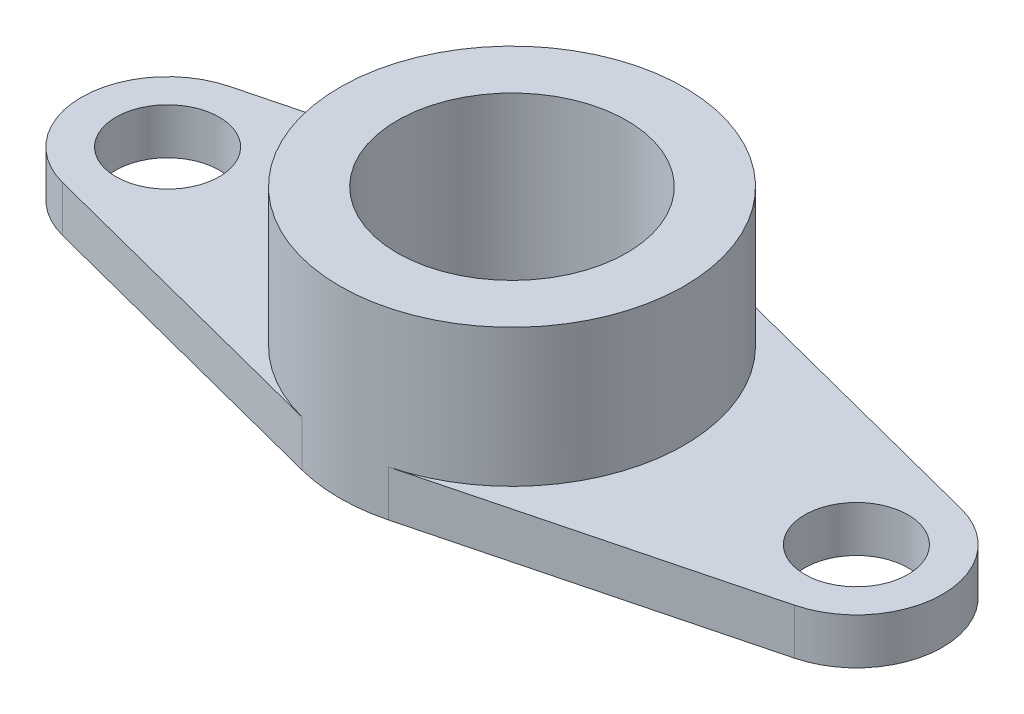
ISO-10303-21;
HEADER;
FILE_DESCRIPTION(('STEP AP214'),'2;1');
FILE_NAME('part.step','',(''),(''),'','','');
FILE_SCHEMA(('AUTOMOTIVE_DESIGN { 1 0 10303 214 1 1 1 1 }'));
ENDSEC;
DATA;
#1=APPLICATION_CONTEXT('core data for automotive mechanical design processes');
#2=APPLICATION_PROTOCOL_DEFINITION('international standard','automotive_design',2000,#1);
#3=PRODUCT_CONTEXT('',#1,'mechanical');
#4=PRODUCT('Part','Part','',(#3));
#5=PRODUCT_RELATED_PRODUCT_CATEGORY('part','',(#4));
#6=PRODUCT_DEFINITION_FORMATION('','',#4);
#7=PRODUCT_DEFINITION_CONTEXT('part definition',#1,'design');
#8=PRODUCT_DEFINITION('design','',#6,#7);
#9=PRODUCT_DEFINITION_SHAPE('','',#8);
#10=(LENGTH_UNIT() NAMED_UNIT(*) SI_UNIT(.MILLI.,.METRE.));
#11=(NAMED_UNIT(*) PLANE_ANGLE_UNIT() SI_UNIT($,.RADIAN.));
#12=(NAMED_UNIT(*) SI_UNIT($,.STERADIAN.) SOLID_ANGLE_UNIT());
#13=UNCERTAINTY_MEASURE_WITH_UNIT(LENGTH_MEASURE(1.E-05),#10,'distance_accuracy_value','');
#14=(GEOMETRIC_REPRESENTATION_CONTEXT(3) GLOBAL_UNCERTAINTY_ASSIGNED_CONTEXT((#13)) GLOBAL_UNIT_ASSIGNED_CONTEXT((#10,
#11,#12)) REPRESENTATION_CONTEXT('',''));
#15=CARTESIAN_POINT('',(0.,0.,0.));
#16=DIRECTION('',(0.,0.,1.));
#17=DIRECTION('',(1.,0.,0.));
#18=AXIS2_PLACEMENT_3D('',#15,#16,#17);
#19=CARTESIAN_POINT('',(0.,2.,0.));
#20=DIRECTION('',(0.,1.,0.));
#21=DIRECTION('',(0.,0.,1.));
#22=AXIS2_PLACEMENT_3D('',#19,#20,#21);
#23=PLANE('',#22);
#24=CARTESIAN_POINT('',(0.,2.,0.));
#25=DIRECTION('',(0.,1.,0.));
#26=DIRECTION('',(0.,0.,1.));
#27=AXIS2_PLACEMENT_3D('',#24,#25,#26);
#28=CIRCLE('',#27,7.5);
#29=CARTESIAN_POINT('',(1.875,2.,7.26184377413891));
#30=VERTEX_POINT('',#29);
#31=CARTESIAN_POINT('',(1.875,2.,-7.26184377413891));
#32=VERTEX_POINT('',#31);
#33=EDGE_CURVE('E46',#30,#32,#28,.T.);
#34=ORIENTED_EDGE('',*,*,#33,.F.);
#35=DIRECTION('',(-0.968245836551854,0.,0.25));
#36=VECTOR('',#35,1.);
#37=CARTESIAN_POINT('',(1.875,2.,7.26184377413891));
#38=LINE('',#37,#36);
#39=CARTESIAN_POINT('',(15.9375,2.,3.63092188706945));
#40=VERTEX_POINT('',#39);
#41=EDGE_CURVE('E115',#40,#30,#38,.T.);
#42=ORIENTED_EDGE('',*,*,#41,.F.);
#43=CARTESIAN_POINT('',(15.,2.,0.));
#44=DIRECTION('',(0.,1.,0.));
#45=DIRECTION('',(0.,0.,1.));
#46=AXIS2_PLACEMENT_3D('',#43,#44,#45);
#47=CIRCLE('',#46,3.75);
#48=CARTESIAN_POINT('',(15.9375,2.,-3.63092188706945));
#49=VERTEX_POINT('',#48);
#50=EDGE_CURVE('E108',#40,#49,#47,.T.);
#51=ORIENTED_EDGE('',*,*,#50,.T.);
#52=DIRECTION('',(-0.968245836551854,0.,-0.25));
#53=VECTOR('',#52,1.);
#54=CARTESIAN_POINT('',(1.875,2.,-7.26184377413891));
#55=LINE('',#54,#53);
#56=EDGE_CURVE('E113',#49,#32,#55,.T.);
#57=ORIENTED_EDGE('',*,*,#56,.T.);
#58=EDGE_LOOP('',(#34,#42,#51,#57));
#59=FACE_BOUND('',#58,.T.);
#60=CARTESIAN_POINT('',(15.,2.,0.));
#61=DIRECTION('',(0.,1.,0.));
#62=DIRECTION('',(0.,0.,1.));
#63=AXIS2_PLACEMENT_3D('',#60,#61,#62);
#64=CIRCLE('',#63,2.25);
#65=CARTESIAN_POINT('',(15.,2.,2.25));
#66=VERTEX_POINT('',#65);
#67=EDGE_CURVE('E130',#66,#66,#64,.T.);
#68=ORIENTED_EDGE('',*,*,#67,.F.);
#69=EDGE_LOOP('',(#68));
#70=FACE_BOUND('',#69,.T.);
#71=ADVANCED_FACE('F35',(#59,#70),#23,.T.);
#72=CARTESIAN_POINT('',(-1.875,2.,-7.26184377413891));
#73=DIRECTION('',(-0.25,0.,-0.968245836551854));
#74=DIRECTION('',(-0.968245836551854,0.,0.25));
#75=AXIS2_PLACEMENT_3D('',#72,#73,#74);
#76=PLANE('',#75);
#77=DIRECTION('',(0.968245836551854,0.,-0.25));
#78=VECTOR('',#77,1.);
#79=CARTESIAN_POINT('',(-1.875,0.,-7.26184377413891));
#80=LINE('',#79,#78);
#81=CARTESIAN_POINT('',(-15.9375,0.,-3.63092188706945));
#82=VERTEX_POINT('',#81);
#83=CARTESIAN_POINT('',(-1.875,0.,-7.26184377413891));
#84=VERTEX_POINT('',#83);
#85=EDGE_CURVE('E136',#82,#84,#80,.T.);
#86=ORIENTED_EDGE('',*,*,#85,.F.);
#87=DIRECTION('',(0.,-1.,0.));
#88=VECTOR('',#87,1.);
#89=CARTESIAN_POINT('',(-15.9375,2.,-3.63092188706945));
#90=LINE('',#89,#88);
#91=CARTESIAN_POINT('',(-15.9375,2.,-3.63092188706945));
#92=VERTEX_POINT('',#91);
#93=EDGE_CURVE('E39',#92,#82,#90,.T.);
#94=ORIENTED_EDGE('',*,*,#93,.F.);
#95=DIRECTION('',(0.968245836551854,0.,-0.25));
#96=VECTOR('',#95,1.);
#97=CARTESIAN_POINT('',(-1.875,2.,-7.26184377413891));
#98=LINE('',#97,#96);
#99=CARTESIAN_POINT('',(-1.875,2.,-7.26184377413891));
#100=VERTEX_POINT('',#99);
#101=EDGE_CURVE('E162',#92,#100,#98,.T.);
#102=ORIENTED_EDGE('',*,*,#101,.T.);
#103=DIRECTION('',(0.,-1.,0.));
#104=VECTOR('',#103,1.);
#105=CARTESIAN_POINT('',(-1.875,2.,-7.26184377413891));
#106=LINE('',#105,#104);
#107=EDGE_CURVE('E90',#100,#84,#106,.T.);
#108=ORIENTED_EDGE('',*,*,#107,.T.);
#109=EDGE_LOOP('',(#86,#94,#102,#108));
#110=FACE_BOUND('',#109,.T.);
#111=ADVANCED_FACE('F37',(#110),#76,.T.);
#112=CARTESIAN_POINT('',(-15.,2.,0.));
#113=DIRECTION('',(0.,-1.,0.));
#114=DIRECTION('',(0.,0.,-1.));
#115=AXIS2_PLACEMENT_3D('',#112,#113,#114);
#116=CYLINDRICAL_SURFACE('',#115,3.75);
#117=CARTESIAN_POINT('',(-15.,0.,0.));
#118=DIRECTION('',(0.,1.,0.));
#119=DIRECTION('',(0.,0.,1.));
#120=AXIS2_PLACEMENT_3D('',#117,#118,#119);
#121=CIRCLE('',#120,3.75);
#122=CARTESIAN_POINT('',(-15.9375,0.,3.63092188706945));
#123=VERTEX_POINT('',#122);
#124=EDGE_CURVE('E139',#82,#123,#121,.T.);
#125=ORIENTED_EDGE('',*,*,#124,.T.);
#126=DIRECTION('',(0.,-1.,0.));
#127=VECTOR('',#126,1.);
#128=CARTESIAN_POINT('',(-15.9375,2.,3.63092188706945));
#129=LINE('',#128,#127);
#130=CARTESIAN_POINT('',(-15.9375,2.,3.63092188706945));
#131=VERTEX_POINT('',#130);
#132=EDGE_CURVE('E170',#131,#123,#129,.T.);
#133=ORIENTED_EDGE('',*,*,#132,.F.);
#134=CARTESIAN_POINT('',(-15.,2.,0.));
#135=DIRECTION('',(0.,1.,0.));
#136=DIRECTION('',(0.,0.,1.));
#137=AXIS2_PLACEMENT_3D('',#134,#135,#136);
#138=CIRCLE('',#137,3.75);
#139=EDGE_CURVE('E179',#92,#131,#138,.T.);
#140=ORIENTED_EDGE('',*,*,#139,.F.);
#141=ORIENTED_EDGE('',*,*,#93,.T.);
#142=EDGE_LOOP('',(#125,#133,#140,#141));
#143=FACE_BOUND('',#142,.T.);
#144=ADVANCED_FACE('F178',(#143),#116,.T.);
#145=CARTESIAN_POINT('',(-1.875,2.,7.26184377413891));
#146=DIRECTION('',(0.25,0.,-0.968245836551854));
#147=DIRECTION('',(-0.968245836551854,0.,-0.25));
#148=AXIS2_PLACEMENT_3D('',#145,#146,#147);
#149=PLANE('',#148);
#150=DIRECTION('',(0.968245836551854,0.,0.25));
#151=VECTOR('',#150,1.);
#152=CARTESIAN_POINT('',(-1.875,0.,7.26184377413891));
#153=LINE('',#152,#151);
#154=CARTESIAN_POINT('',(-1.875,0.,7.26184377413891));
#155=VERTEX_POINT('',#154);
#156=EDGE_CURVE('E142',#123,#155,#153,.T.);
#157=ORIENTED_EDGE('',*,*,#156,.T.);
#158=DIRECTION('',(0.,-1.,0.));
#159=VECTOR('',#158,1.);
#160=CARTESIAN_POINT('',(-1.875,2.,7.26184377413891));
#161=LINE('',#160,#159);
#162=CARTESIAN_POINT('',(-1.875,2.,7.26184377413891));
#163=VERTEX_POINT('',#162);
#164=EDGE_CURVE('E168',#163,#155,#161,.T.);
#165=ORIENTED_EDGE('',*,*,#164,.F.);
#166=DIRECTION('',(0.968245836551854,0.,0.25));
#167=VECTOR('',#166,1.);
#168=CARTESIAN_POINT('',(-1.875,2.,7.26184377413891));
#169=LINE('',#168,#167);
#170=EDGE_CURVE('E235',#131,#163,#169,.T.);
#171=ORIENTED_EDGE('',*,*,#170,.F.);
#172=ORIENTED_EDGE('',*,*,#132,.T.);
#173=EDGE_LOOP('',(#157,#165,#171,#172));
#174=FACE_BOUND('',#173,.T.);
#175=ADVANCED_FACE('F190',(#174),#149,.F.);
#176=CARTESIAN_POINT('',(1.875,2.,7.26184377413891));
#177=DIRECTION('',(0.25,0.,0.968245836551854));
#178=DIRECTION('',(0.968245836551854,0.,-0.25));
#179=AXIS2_PLACEMENT_3D('',#176,#177,#178);
#180=PLANE('',#179);
#181=DIRECTION('',(-0.968245836551854,0.,0.25));
#182=VECTOR('',#181,1.);
#183=CARTESIAN_POINT('',(1.875,0.,7.26184377413891));
#184=LINE('',#183,#182);
#185=CARTESIAN_POINT('',(15.9375,0.,3.63092188706945));
#186=VERTEX_POINT('',#185);
#187=CARTESIAN_POINT('',(1.875,0.,7.26184377413891));
#188=VERTEX_POINT('',#187);
#189=EDGE_CURVE('E147',#186,#188,#184,.T.);
#190=ORIENTED_EDGE('',*,*,#189,.F.);
#191=DIRECTION('',(0.,-1.,0.));
#192=VECTOR('',#191,1.);
#193=CARTESIAN_POINT('',(15.9375,2.,3.63092188706945));
#194=LINE('',#193,#192);
#195=EDGE_CURVE('E122',#40,#186,#194,.T.);
#196=ORIENTED_EDGE('',*,*,#195,.F.);
#197=ORIENTED_EDGE('',*,*,#41,.T.);
#198=DIRECTION('',(0.,-1.,0.));
#199=VECTOR('',#198,1.);
#200=CARTESIAN_POINT('',(1.875,2.,7.26184377413891));
#201=LINE('',#200,#199);
#202=EDGE_CURVE('E166',#30,#188,#201,.T.);
#203=ORIENTED_EDGE('',*,*,#202,.T.);
#204=EDGE_LOOP('',(#190,#196,#197,#203));
#205=FACE_BOUND('',#204,.T.);
#206=ADVANCED_FACE('F239',(#205),#180,.T.);
#207=CARTESIAN_POINT('',(15.,2.,0.));
#208=DIRECTION('',(0.,-1.,0.));
#209=DIRECTION('',(0.,0.,-1.));
#210=AXIS2_PLACEMENT_3D('',#207,#208,#209);
#211=CYLINDRICAL_SURFACE('',#210,3.75);
#212=CARTESIAN_POINT('',(15.,0.,0.));
#213=DIRECTION('',(0.,1.,0.));
#214=DIRECTION('',(0.,0.,1.));
#215=AXIS2_PLACEMENT_3D('',#212,#213,#214);
#216=CIRCLE('',#215,3.75);
#217=CARTESIAN_POINT('',(15.9375,0.,-3.63092188706945));
#218=VERTEX_POINT('',#217);
#219=EDGE_CURVE('E121',#186,#218,#216,.T.);
#220=ORIENTED_EDGE('',*,*,#219,.T.);
#221=DIRECTION('',(0.,-1.,0.));
#222=VECTOR('',#221,1.);
#223=CARTESIAN_POINT('',(15.9375,2.,-3.63092188706945));
#224=LINE('',#223,#222);
#225=EDGE_CURVE('E118',#49,#218,#224,.T.);
#226=ORIENTED_EDGE('',*,*,#225,.F.);
#227=ORIENTED_EDGE('',*,*,#50,.F.);
#228=ORIENTED_EDGE('',*,*,#195,.T.);
#229=EDGE_LOOP('',(#220,#226,#227,#228));
#230=FACE_BOUND('',#229,.T.);
#231=ADVANCED_FACE('F119',(#230),#211,.T.);
#232=CARTESIAN_POINT('',(1.875,2.,-7.26184377413891));
#233=DIRECTION('',(-0.25,0.,0.968245836551854));
#234=DIRECTION('',(0.968245836551854,0.,0.25));
#235=AXIS2_PLACEMENT_3D('',#232,#233,#234);
#236=PLANE('',#235);
#237=DIRECTION('',(-0.968245836551854,0.,-0.25));
#238=VECTOR('',#237,1.);
#239=CARTESIAN_POINT('',(1.875,0.,-7.26184377413891));
#240=LINE('',#239,#238);
#241=CARTESIAN_POINT('',(1.875,0.,-7.26184377413891));
#242=VERTEX_POINT('',#241);
#243=EDGE_CURVE('E83',#218,#242,#240,.T.);
#244=ORIENTED_EDGE('',*,*,#243,.T.);
#245=DIRECTION('',(0.,-1.,0.));
#246=VECTOR('',#245,1.);
#247=CARTESIAN_POINT('',(1.875,2.,-7.26184377413891));
#248=LINE('',#247,#246);
#249=EDGE_CURVE('E123',#32,#242,#248,.T.);
#250=ORIENTED_EDGE('',*,*,#249,.F.);
#251=ORIENTED_EDGE('',*,*,#56,.F.);
#252=ORIENTED_EDGE('',*,*,#225,.T.);
#253=EDGE_LOOP('',(#244,#250,#251,#252));
#254=FACE_BOUND('',#253,.T.);
#255=ADVANCED_FACE('F125',(#254),#236,.F.);
#256=CARTESIAN_POINT('',(0.,2.,0.));
#257=DIRECTION('',(0.,-1.,0.));
#258=DIRECTION('',(0.,0.,-1.));
#259=AXIS2_PLACEMENT_3D('',#256,#257,#258);
#260=CYLINDRICAL_SURFACE('',#259,5.);
#261=CARTESIAN_POINT('',(0.,0.,0.));
#262=DIRECTION('',(0.,1.,0.));
#263=DIRECTION('',(0.,0.,1.));
#264=AXIS2_PLACEMENT_3D('',#261,#262,#263);
#265=CIRCLE('',#264,5.);
#266=CARTESIAN_POINT('',(0.,0.,5.));
#267=VERTEX_POINT('',#266);
#268=EDGE_CURVE('E156',#267,#267,#265,.T.);
#269=ORIENTED_EDGE('',*,*,#268,.F.);
#270=EDGE_LOOP('',(#269));
#271=FACE_BOUND('',#270,.T.);
#272=CARTESIAN_POINT('',(0.,8.,0.));
#273=DIRECTION('',(0.,1.,0.));
#274=DIRECTION('',(0.,0.,1.));
#275=AXIS2_PLACEMENT_3D('',#272,#273,#274);
#276=CIRCLE('',#275,5.);
#277=CARTESIAN_POINT('',(0.,8.,5.));
#278=VERTEX_POINT('',#277);
#279=EDGE_CURVE('E227',#278,#278,#276,.T.);
#280=ORIENTED_EDGE('',*,*,#279,.T.);
#281=EDGE_LOOP('',(#280));
#282=FACE_BOUND('',#281,.T.);
#283=ADVANCED_FACE('F213',(#271,#282),#260,.F.);
#284=CARTESIAN_POINT('',(-15.,2.,0.));
#285=DIRECTION('',(0.,-1.,0.));
#286=DIRECTION('',(0.,0.,-1.));
#287=AXIS2_PLACEMENT_3D('',#284,#285,#286);
#288=CYLINDRICAL_SURFACE('',#287,2.25);
#289=CARTESIAN_POINT('',(-15.,2.,0.));
#290=DIRECTION('',(0.,1.,0.));
#291=DIRECTION('',(0.,0.,1.));
#292=AXIS2_PLACEMENT_3D('',#289,#290,#291);
#293=CIRCLE('',#292,2.25);
#294=CARTESIAN_POINT('',(-15.,2.,2.25));
#295=VERTEX_POINT('',#294);
#296=EDGE_CURVE('E127',#295,#295,#293,.T.);
#297=ORIENTED_EDGE('',*,*,#296,.T.);
#298=EDGE_LOOP('',(#297));
#299=FACE_BOUND('',#298,.T.);
#300=CARTESIAN_POINT('',(-15.,0.,0.));
#301=DIRECTION('',(0.,1.,0.));
#302=DIRECTION('',(0.,0.,1.));
#303=AXIS2_PLACEMENT_3D('',#300,#301,#302);
#304=CIRCLE('',#303,2.25);
#305=CARTESIAN_POINT('',(-15.,0.,2.25));
#306=VERTEX_POINT('',#305);
#307=EDGE_CURVE('E153',#306,#306,#304,.T.);
#308=ORIENTED_EDGE('',*,*,#307,.F.);
#309=EDGE_LOOP('',(#308));
#310=FACE_BOUND('',#309,.T.);
#311=ADVANCED_FACE('F210',(#299,#310),#288,.F.);
#312=CARTESIAN_POINT('',(0.,2.,0.));
#313=DIRECTION('',(0.,-1.,0.));
#314=DIRECTION('',(0.,0.,-1.));
#315=AXIS2_PLACEMENT_3D('',#312,#313,#314);
#316=CYLINDRICAL_SURFACE('',#315,7.5);
#317=CARTESIAN_POINT('',(0.,0.,0.));
#318=DIRECTION('',(0.,1.,0.));
#319=DIRECTION('',(0.,0.,1.));
#320=AXIS2_PLACEMENT_3D('',#317,#318,#319);
#321=CIRCLE('',#320,7.5);
#322=EDGE_CURVE('E148',#242,#84,#321,.T.);
#323=ORIENTED_EDGE('',*,*,#322,.T.);
#324=ORIENTED_EDGE('',*,*,#107,.F.);
#325=EDGE_CURVE('E11',#100,#163,#28,.T.);
#326=ORIENTED_EDGE('',*,*,#325,.T.);
#327=ORIENTED_EDGE('',*,*,#164,.T.);
#328=EDGE_CURVE('E144',#155,#188,#321,.T.);
#329=ORIENTED_EDGE('',*,*,#328,.T.);
#330=ORIENTED_EDGE('',*,*,#202,.F.);
#331=ORIENTED_EDGE('',*,*,#33,.T.);
#332=ORIENTED_EDGE('',*,*,#249,.T.);
#333=EDGE_LOOP('',(#323,#324,#326,#327,#329,#330,#331,#332));
#334=FACE_BOUND('',#333,.T.);
#335=CARTESIAN_POINT('',(0.,8.,0.));
#336=DIRECTION('',(0.,1.,0.));
#337=DIRECTION('',(0.,0.,1.));
#338=AXIS2_PLACEMENT_3D('',#335,#336,#337);
#339=CIRCLE('',#338,7.5);
#340=CARTESIAN_POINT('',(0.,8.,7.5));
#341=VERTEX_POINT('',#340);
#342=EDGE_CURVE('E140',#341,#341,#339,.T.);
#343=ORIENTED_EDGE('',*,*,#342,.F.);
#344=EDGE_LOOP('',(#343));
#345=FACE_BOUND('',#344,.T.);
#346=ADVANCED_FACE('F204',(#334,#345),#316,.T.);
#347=CARTESIAN_POINT('',(15.,2.,0.));
#348=DIRECTION('',(0.,-1.,0.));
#349=DIRECTION('',(0.,0.,-1.));
#350=AXIS2_PLACEMENT_3D('',#347,#348,#349);
#351=CYLINDRICAL_SURFACE('',#350,2.25);
#352=ORIENTED_EDGE('',*,*,#67,.T.);
#353=EDGE_LOOP('',(#352));
#354=FACE_BOUND('',#353,.T.);
#355=CARTESIAN_POINT('',(15.,0.,0.));
#356=DIRECTION('',(0.,1.,0.));
#357=DIRECTION('',(0.,0.,1.));
#358=AXIS2_PLACEMENT_3D('',#355,#356,#357);
#359=CIRCLE('',#358,2.25);
#360=CARTESIAN_POINT('',(15.,0.,2.25));
#361=VERTEX_POINT('',#360);
#362=EDGE_CURVE('E159',#361,#361,#359,.T.);
#363=ORIENTED_EDGE('',*,*,#362,.F.);
#364=EDGE_LOOP('',(#363));
#365=FACE_BOUND('',#364,.T.);
#366=ADVANCED_FACE('F198',(#354,#365),#351,.F.);
#367=ORIENTED_EDGE('',*,*,#325,.F.);
#368=ORIENTED_EDGE('',*,*,#101,.F.);
#369=ORIENTED_EDGE('',*,*,#139,.T.);
#370=ORIENTED_EDGE('',*,*,#170,.T.);
#371=EDGE_LOOP('',(#367,#368,#369,#370));
#372=FACE_BOUND('',#371,.T.);
#373=ORIENTED_EDGE('',*,*,#296,.F.);
#374=EDGE_LOOP('',(#373));
#375=FACE_BOUND('',#374,.T.);
#376=ADVANCED_FACE('F192',(#372,#375),#23,.T.);
#377=CARTESIAN_POINT('',(0.,0.,0.));
#378=DIRECTION('',(0.,1.,0.));
#379=DIRECTION('',(0.,0.,1.));
#380=AXIS2_PLACEMENT_3D('',#377,#378,#379);
#381=PLANE('',#380);
#382=ORIENTED_EDGE('',*,*,#85,.T.);
#383=ORIENTED_EDGE('',*,*,#322,.F.);
#384=ORIENTED_EDGE('',*,*,#243,.F.);
#385=ORIENTED_EDGE('',*,*,#219,.F.);
#386=ORIENTED_EDGE('',*,*,#189,.T.);
#387=ORIENTED_EDGE('',*,*,#328,.F.);
#388=ORIENTED_EDGE('',*,*,#156,.F.);
#389=ORIENTED_EDGE('',*,*,#124,.F.);
#390=EDGE_LOOP('',(#382,#383,#384,#385,#386,#387,#388,#389));
#391=FACE_BOUND('',#390,.T.);
#392=ORIENTED_EDGE('',*,*,#307,.T.);
#393=EDGE_LOOP('',(#392));
#394=FACE_BOUND('',#393,.T.);
#395=ORIENTED_EDGE('',*,*,#268,.T.);
#396=EDGE_LOOP('',(#395));
#397=FACE_BOUND('',#396,.T.);
#398=ORIENTED_EDGE('',*,*,#362,.T.);
#399=EDGE_LOOP('',(#398));
#400=FACE_BOUND('',#399,.T.);
#401=ADVANCED_FACE('F181',(#391,#394,#397,#400),#381,.F.);
#402=CARTESIAN_POINT('',(0.,8.,0.));
#403=DIRECTION('',(0.,1.,0.));
#404=DIRECTION('',(0.,0.,1.));
#405=AXIS2_PLACEMENT_3D('',#402,#403,#404);
#406=PLANE('',#405);
#407=ORIENTED_EDGE('',*,*,#342,.T.);
#408=EDGE_LOOP('',(#407));
#409=FACE_BOUND('',#408,.T.);
#410=ORIENTED_EDGE('',*,*,#279,.F.);
#411=EDGE_LOOP('',(#410));
#412=FACE_BOUND('',#411,.T.);
#413=ADVANCED_FACE('F203',(#409,#412),#406,.T.);
#414=CLOSED_SHELL('',(#71,#111,#144,#175,#206,#231,#255,#283,#311,#346,#366,#376,#401,#413));
#415=MANIFOLD_SOLID_BREP('B2',#414);
#416=ADVANCED_BREP_SHAPE_REPRESENTATION('',(#18,#415),#14);
#417=SHAPE_DEFINITION_REPRESENTATION(#9,#416);
ENDSEC;
END-ISO-10303-21;
